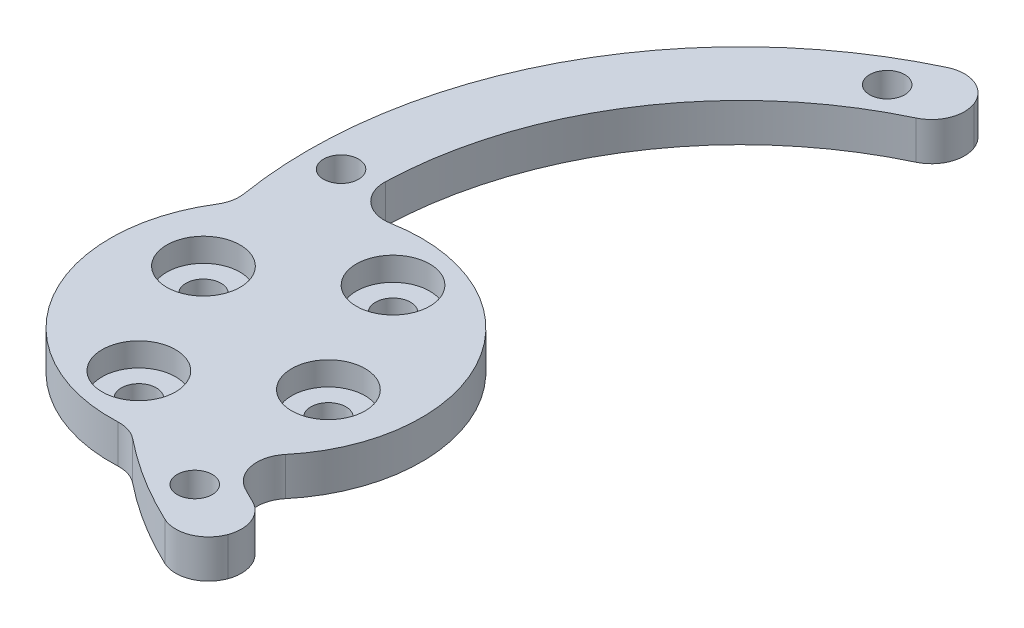
ISO-10303-21;
HEADER;
FILE_DESCRIPTION(('STEP AP214'),'2;1');
FILE_NAME('part.step','',(''),(''),'','','');
FILE_SCHEMA(('AUTOMOTIVE_DESIGN { 1 0 10303 214 1 1 1 1 }'));
ENDSEC;
DATA;
#1=APPLICATION_CONTEXT('core data for automotive mechanical design processes');
#2=APPLICATION_PROTOCOL_DEFINITION('international standard','automotive_design',2000,#1);
#3=PRODUCT_CONTEXT('',#1,'mechanical');
#4=PRODUCT('Part','Part','',(#3));
#5=PRODUCT_RELATED_PRODUCT_CATEGORY('part','',(#4));
#6=PRODUCT_DEFINITION_FORMATION('','',#4);
#7=PRODUCT_DEFINITION_CONTEXT('part definition',#1,'design');
#8=PRODUCT_DEFINITION('design','',#6,#7);
#9=PRODUCT_DEFINITION_SHAPE('','',#8);
#10=(LENGTH_UNIT() NAMED_UNIT(*) SI_UNIT(.MILLI.,.METRE.));
#11=(NAMED_UNIT(*) PLANE_ANGLE_UNIT() SI_UNIT($,.RADIAN.));
#12=(NAMED_UNIT(*) SI_UNIT($,.STERADIAN.) SOLID_ANGLE_UNIT());
#13=UNCERTAINTY_MEASURE_WITH_UNIT(LENGTH_MEASURE(1.E-05),#10,'distance_accuracy_value','');
#14=(GEOMETRIC_REPRESENTATION_CONTEXT(3) GLOBAL_UNCERTAINTY_ASSIGNED_CONTEXT((#13)) GLOBAL_UNIT_ASSIGNED_CONTEXT((#10,
#11,#12)) REPRESENTATION_CONTEXT('',''));
#15=CARTESIAN_POINT('',(0.,0.,0.));
#16=DIRECTION('',(0.,0.,1.));
#17=DIRECTION('',(1.,0.,0.));
#18=AXIS2_PLACEMENT_3D('',#15,#16,#17);
#19=CARTESIAN_POINT('',(-27.3778082191781,3.5,15.979537449936));
#20=DIRECTION('',(0.,-1.,0.));
#21=DIRECTION('',(0.,0.,-1.));
#22=AXIS2_PLACEMENT_3D('',#19,#20,#21);
#23=CYLINDRICAL_SURFACE('',#22,14.2);
#24=CARTESIAN_POINT('',(-27.3778082191781,0.,15.979537449936));
#25=DIRECTION('',(0.,1.,0.));
#26=DIRECTION('',(0.,0.,1.));
#27=AXIS2_PLACEMENT_3D('',#24,#25,#26);
#28=CIRCLE('',#27,14.2);
#29=CARTESIAN_POINT('',(-39.4054645314723,0.,8.43132682533564));
#30=VERTEX_POINT('',#29);
#31=CARTESIAN_POINT('',(-26.7206212695849,0.,30.1643217385067));
#32=VERTEX_POINT('',#31);
#33=EDGE_CURVE('E252',#30,#32,#28,.T.);
#34=ORIENTED_EDGE('',*,*,#33,.T.);
#35=DIRECTION('',(0.,-1.,0.));
#36=VECTOR('',#35,1.);
#37=CARTESIAN_POINT('',(-26.7206212695849,3.5,30.1643217385067));
#38=LINE('',#37,#36);
#39=CARTESIAN_POINT('',(-26.7206212695849,3.5,30.1643217385067));
#40=VERTEX_POINT('',#39);
#41=EDGE_CURVE('E201',#32,#40,#38,.F.);
#42=ORIENTED_EDGE('',*,*,#41,.T.);
#43=CARTESIAN_POINT('',(-27.3778082191781,3.5,15.979537449936));
#44=DIRECTION('',(0.,1.,0.));
#45=DIRECTION('',(0.,0.,1.));
#46=AXIS2_PLACEMENT_3D('',#43,#44,#45);
#47=CIRCLE('',#46,14.2);
#48=CARTESIAN_POINT('',(-39.4054645314723,3.5,8.43132682533564));
#49=VERTEX_POINT('',#48);
#50=EDGE_CURVE('E253',#49,#40,#47,.T.);
#51=ORIENTED_EDGE('',*,*,#50,.F.);
#52=DIRECTION('',(0.,-1.,0.));
#53=VECTOR('',#52,1.);
#54=CARTESIAN_POINT('',(-39.4054645314723,3.5,8.43132682533564));
#55=LINE('',#54,#53);
#56=EDGE_CURVE('E198',#49,#30,#55,.T.);
#57=ORIENTED_EDGE('',*,*,#56,.T.);
#58=EDGE_LOOP('',(#34,#42,#51,#57));
#59=FACE_BOUND('',#58,.T.);
#60=ADVANCED_FACE('F35',(#59),#23,.T.);
#61=CARTESIAN_POINT('',(0.,3.5,0.));
#62=DIRECTION('',(0.,-1.,0.));
#63=DIRECTION('',(0.,0.,-1.));
#64=AXIS2_PLACEMENT_3D('',#61,#62,#63);
#65=CYLINDRICAL_SURFACE('',#64,39.5);
#66=CARTESIAN_POINT('',(0.,0.,0.));
#67=DIRECTION('',(0.,1.,0.));
#68=DIRECTION('',(0.,0.,1.));
#69=AXIS2_PLACEMENT_3D('',#66,#67,#68);
#70=CIRCLE('',#69,39.5);
#71=CARTESIAN_POINT('',(-24.7054180887877,0.,30.8203231173555));
#72=VERTEX_POINT('',#71);
#73=CARTESIAN_POINT('',(-16.8715597782838,0.,35.7155494238545));
#74=VERTEX_POINT('',#73);
#75=EDGE_CURVE('E268',#72,#74,#70,.T.);
#76=ORIENTED_EDGE('',*,*,#75,.T.);
#77=DIRECTION('',(0.,-1.,0.));
#78=VECTOR('',#77,1.);
#79=CARTESIAN_POINT('',(-16.8715597782838,3.5,35.7155494238545));
#80=LINE('',#79,#78);
#81=CARTESIAN_POINT('',(-16.8715597782838,3.5,35.7155494238545));
#82=VERTEX_POINT('',#81);
#83=EDGE_CURVE('E196',#74,#82,#80,.F.);
#84=ORIENTED_EDGE('',*,*,#83,.T.);
#85=CARTESIAN_POINT('',(0.,3.5,0.));
#86=DIRECTION('',(0.,1.,0.));
#87=DIRECTION('',(0.,0.,1.));
#88=AXIS2_PLACEMENT_3D('',#85,#86,#87);
#89=CIRCLE('',#88,39.5);
#90=CARTESIAN_POINT('',(-24.7054180887877,3.5,30.8203231173555));
#91=VERTEX_POINT('',#90);
#92=EDGE_CURVE('E256',#91,#82,#89,.T.);
#93=ORIENTED_EDGE('',*,*,#92,.F.);
#94=DIRECTION('',(0.,-1.,0.));
#95=VECTOR('',#94,1.);
#96=CARTESIAN_POINT('',(-24.7054180887877,3.5,30.8203231173555));
#97=LINE('',#96,#95);
#98=EDGE_CURVE('E193',#91,#72,#97,.T.);
#99=ORIENTED_EDGE('',*,*,#98,.T.);
#100=EDGE_LOOP('',(#76,#84,#93,#99));
#101=FACE_BOUND('',#100,.T.);
#102=ADVANCED_FACE('F302',(#101),#65,.T.);
#103=CARTESIAN_POINT('',(0.,3.5,0.));
#104=DIRECTION('',(0.,-1.,0.));
#105=DIRECTION('',(0.,0.,-1.));
#106=AXIS2_PLACEMENT_3D('',#103,#104,#105);
#107=CYLINDRICAL_SURFACE('',#106,33.5);
#108=CARTESIAN_POINT('',(0.,0.,0.));
#109=DIRECTION('',(0.,1.,0.));
#110=DIRECTION('',(0.,0.,1.));
#111=AXIS2_PLACEMENT_3D('',#108,#109,#110);
#112=CIRCLE('',#111,33.5);
#113=CARTESIAN_POINT('',(-15.5708562956568,0.,29.6613963632868));
#114=VERTEX_POINT('',#113);
#115=CARTESIAN_POINT('',(-14.3087912043673,0.,30.2904026759273));
#116=VERTEX_POINT('',#115);
#117=EDGE_CURVE('E271',#114,#116,#112,.T.);
#118=ORIENTED_EDGE('',*,*,#117,.F.);
#119=DIRECTION('',(0.,-1.,0.));
#120=VECTOR('',#119,1.);
#121=CARTESIAN_POINT('',(-15.5708562956568,3.5,29.6613963632868));
#122=LINE('',#121,#120);
#123=CARTESIAN_POINT('',(-15.5708562956568,3.5,29.6613963632868));
#124=VERTEX_POINT('',#123);
#125=EDGE_CURVE('E181',#114,#124,#122,.F.);
#126=ORIENTED_EDGE('',*,*,#125,.T.);
#127=CARTESIAN_POINT('',(0.,3.5,0.));
#128=DIRECTION('',(0.,1.,0.));
#129=DIRECTION('',(0.,0.,1.));
#130=AXIS2_PLACEMENT_3D('',#127,#128,#129);
#131=CIRCLE('',#130,33.5);
#132=CARTESIAN_POINT('',(-14.3087912043673,3.5,30.2904026759273));
#133=VERTEX_POINT('',#132);
#134=EDGE_CURVE('E259',#124,#133,#131,.T.);
#135=ORIENTED_EDGE('',*,*,#134,.T.);
#136=DIRECTION('',(0.,-1.,0.));
#137=VECTOR('',#136,1.);
#138=CARTESIAN_POINT('',(-14.3087912043673,3.5,30.2904026759273));
#139=LINE('',#138,#137);
#140=EDGE_CURVE('E178',#133,#116,#139,.T.);
#141=ORIENTED_EDGE('',*,*,#140,.T.);
#142=EDGE_LOOP('',(#118,#126,#135,#141));
#143=FACE_BOUND('',#142,.T.);
#144=ADVANCED_FACE('F291',(#143),#107,.F.);
#145=CARTESIAN_POINT('',(-27.3778082191781,3.5,15.979537449936));
#146=DIRECTION('',(0.,-1.,0.));
#147=DIRECTION('',(0.,0.,-1.));
#148=AXIS2_PLACEMENT_3D('',#145,#146,#147);
#149=CYLINDRICAL_SURFACE('',#148,14.2);
#150=CARTESIAN_POINT('',(-27.3778082191781,0.,15.979537449936));
#151=DIRECTION('',(0.,1.,0.));
#152=DIRECTION('',(0.,0.,1.));
#153=AXIS2_PLACEMENT_3D('',#150,#151,#152);
#154=CIRCLE('',#153,14.2);
#155=CARTESIAN_POINT('',(-16.4790135155786,0.,25.0820796228013));
#156=VERTEX_POINT('',#155);
#157=CARTESIAN_POINT('',(-29.94353699167,0.,2.01325534387757));
#158=VERTEX_POINT('',#157);
#159=EDGE_CURVE('E162',#156,#158,#154,.T.);
#160=ORIENTED_EDGE('',*,*,#159,.T.);
#161=DIRECTION('',(0.,-1.,0.));
#162=VECTOR('',#161,1.);
#163=CARTESIAN_POINT('',(-29.94353699167,3.5,2.01325534387757));
#164=LINE('',#163,#162);
#165=CARTESIAN_POINT('',(-29.94353699167,3.5,2.01325534387757));
#166=VERTEX_POINT('',#165);
#167=EDGE_CURVE('E176',#158,#166,#164,.F.);
#168=ORIENTED_EDGE('',*,*,#167,.T.);
#169=CARTESIAN_POINT('',(-27.3778082191781,3.5,15.979537449936));
#170=DIRECTION('',(0.,1.,0.));
#171=DIRECTION('',(0.,0.,1.));
#172=AXIS2_PLACEMENT_3D('',#169,#170,#171);
#173=CIRCLE('',#172,14.2);
#174=CARTESIAN_POINT('',(-16.4790135155786,3.5,25.0820796228013));
#175=VERTEX_POINT('',#174);
#176=EDGE_CURVE('E262',#175,#166,#173,.T.);
#177=ORIENTED_EDGE('',*,*,#176,.F.);
#178=DIRECTION('',(0.,-1.,0.));
#179=VECTOR('',#178,1.);
#180=CARTESIAN_POINT('',(-16.4790135155786,3.5,25.0820796228013));
#181=LINE('',#180,#179);
#182=EDGE_CURVE('E168',#175,#156,#181,.T.);
#183=ORIENTED_EDGE('',*,*,#182,.T.);
#184=EDGE_LOOP('',(#160,#168,#177,#183));
#185=FACE_BOUND('',#184,.T.);
#186=ADVANCED_FACE('F277',(#185),#149,.T.);
#187=CARTESIAN_POINT('',(0.,3.5,0.));
#188=DIRECTION('',(0.,-1.,0.));
#189=DIRECTION('',(0.,0.,-1.));
#190=AXIS2_PLACEMENT_3D('',#187,#188,#189);
#191=CYLINDRICAL_SURFACE('',#190,33.5);
#192=CARTESIAN_POINT('',(0.,3.5,0.));
#193=DIRECTION('',(0.,1.,0.));
#194=DIRECTION('',(0.,0.,1.));
#195=AXIS2_PLACEMENT_3D('',#192,#193,#194);
#196=CIRCLE('',#195,33.5);
#197=CARTESIAN_POINT('',(-14.3087912043673,3.5,-30.2904026759272));
#198=VERTEX_POINT('',#197);
#199=CARTESIAN_POINT('',(-33.4841752218261,3.5,-1.02956773164699));
#200=VERTEX_POINT('',#199);
#201=EDGE_CURVE('E170',#198,#200,#196,.T.);
#202=ORIENTED_EDGE('',*,*,#201,.T.);
#203=DIRECTION('',(0.,-1.,0.));
#204=VECTOR('',#203,1.);
#205=CARTESIAN_POINT('',(-33.4841752218261,3.5,-1.02956773164699));
#206=LINE('',#205,#204);
#207=CARTESIAN_POINT('',(-33.4841752218261,0.,-1.02956773164699));
#208=VERTEX_POINT('',#207);
#209=EDGE_CURVE('E160',#200,#208,#206,.T.);
#210=ORIENTED_EDGE('',*,*,#209,.T.);
#211=CARTESIAN_POINT('',(0.,0.,0.));
#212=DIRECTION('',(0.,1.,0.));
#213=DIRECTION('',(0.,0.,1.));
#214=AXIS2_PLACEMENT_3D('',#211,#212,#213);
#215=CIRCLE('',#214,33.5);
#216=CARTESIAN_POINT('',(-14.3087912043673,0.,-30.2904026759272));
#217=VERTEX_POINT('',#216);
#218=EDGE_CURVE('E142',#217,#208,#215,.T.);
#219=ORIENTED_EDGE('',*,*,#218,.F.);
#220=DIRECTION('',(0.,-1.,0.));
#221=VECTOR('',#220,1.);
#222=CARTESIAN_POINT('',(-14.3087912043673,3.5,-30.2904026759272));
#223=LINE('',#222,#221);
#224=EDGE_CURVE('E157',#217,#198,#223,.F.);
#225=ORIENTED_EDGE('',*,*,#224,.T.);
#226=EDGE_LOOP('',(#202,#210,#219,#225));
#227=FACE_BOUND('',#226,.T.);
#228=ADVANCED_FACE('F156',(#227),#191,.F.);
#229=CARTESIAN_POINT('',(0.,3.5,0.));
#230=DIRECTION('',(0.,-1.,0.));
#231=DIRECTION('',(0.,0.,-1.));
#232=AXIS2_PLACEMENT_3D('',#229,#230,#231);
#233=CYLINDRICAL_SURFACE('',#232,39.5);
#234=CARTESIAN_POINT('',(0.,0.,0.));
#235=DIRECTION('',(0.,1.,0.));
#236=DIRECTION('',(0.,0.,1.));
#237=AXIS2_PLACEMENT_3D('',#234,#235,#236);
#238=CIRCLE('',#237,39.5);
#239=CARTESIAN_POINT('',(-16.8715597782839,0.,-35.7155494238545));
#240=VERTEX_POINT('',#239);
#241=CARTESIAN_POINT('',(-38.9855879514659,0.,6.35404847939623));
#242=VERTEX_POINT('',#241);
#243=EDGE_CURVE('E161',#240,#242,#238,.T.);
#244=ORIENTED_EDGE('',*,*,#243,.T.);
#245=DIRECTION('',(0.,-1.,0.));
#246=VECTOR('',#245,1.);
#247=CARTESIAN_POINT('',(-38.9855879514659,3.5,6.35404847939623));
#248=LINE('',#247,#246);
#249=CARTESIAN_POINT('',(-38.9855879514659,3.5,6.35404847939623));
#250=VERTEX_POINT('',#249);
#251=EDGE_CURVE('E52',#242,#250,#248,.F.);
#252=ORIENTED_EDGE('',*,*,#251,.T.);
#253=CARTESIAN_POINT('',(0.,3.5,0.));
#254=DIRECTION('',(0.,1.,0.));
#255=DIRECTION('',(0.,0.,1.));
#256=AXIS2_PLACEMENT_3D('',#253,#254,#255);
#257=CIRCLE('',#256,39.5);
#258=CARTESIAN_POINT('',(-16.8715597782839,3.5,-35.7155494238545));
#259=VERTEX_POINT('',#258);
#260=EDGE_CURVE('E166',#259,#250,#257,.T.);
#261=ORIENTED_EDGE('',*,*,#260,.F.);
#262=DIRECTION('',(0.,-1.,0.));
#263=VECTOR('',#262,1.);
#264=CARTESIAN_POINT('',(-16.8715597782839,3.5,-35.7155494238545));
#265=LINE('',#264,#263);
#266=EDGE_CURVE('E203',#259,#240,#265,.T.);
#267=ORIENTED_EDGE('',*,*,#266,.T.);
#268=EDGE_LOOP('',(#244,#252,#261,#267));
#269=FACE_BOUND('',#268,.T.);
#270=ADVANCED_FACE('F315',(#269),#233,.T.);
#271=CARTESIAN_POINT('',(0.,3.5,0.));
#272=DIRECTION('',(0.,1.,0.));
#273=DIRECTION('',(0.,0.,1.));
#274=AXIS2_PLACEMENT_3D('',#271,#272,#273);
#275=PLANE('',#274);
#276=CARTESIAN_POINT('',(-24.9624123747001,3.5,6.79172688841051));
#277=DIRECTION('',(0.,1.,0.));
#278=DIRECTION('',(0.,0.,1.));
#279=AXIS2_PLACEMENT_3D('',#276,#277,#278);
#280=CIRCLE('',#279,3.35);
#281=CARTESIAN_POINT('',(-24.9624123747001,3.5,10.1417268884105));
#282=VERTEX_POINT('',#281);
#283=EDGE_CURVE('E617',#282,#282,#280,.T.);
#284=ORIENTED_EDGE('',*,*,#283,.F.);
#285=EDGE_LOOP('',(#284));
#286=FACE_BOUND('',#285,.T.);
#287=CARTESIAN_POINT('',(-19.6407045884198,3.5,18.0135550031805));
#288=DIRECTION('',(0.,1.,0.));
#289=DIRECTION('',(0.,0.,1.));
#290=AXIS2_PLACEMENT_3D('',#287,#288,#289);
#291=CIRCLE('',#290,3.35);
#292=CARTESIAN_POINT('',(-19.6407045884198,3.5,21.3635550031805));
#293=VERTEX_POINT('',#292);
#294=EDGE_CURVE('E627',#293,#293,#291,.T.);
#295=ORIENTED_EDGE('',*,*,#294,.F.);
#296=EDGE_LOOP('',(#295));
#297=FACE_BOUND('',#296,.T.);
#298=CARTESIAN_POINT('',(-35.1149118499364,3.5,13.9455198966914));
#299=DIRECTION('',(0.,1.,0.));
#300=DIRECTION('',(0.,0.,1.));
#301=AXIS2_PLACEMENT_3D('',#298,#299,#300);
#302=CIRCLE('',#301,3.35);
#303=CARTESIAN_POINT('',(-35.1149118499364,3.5,17.2955198966914));
#304=VERTEX_POINT('',#303);
#305=EDGE_CURVE('E639',#304,#304,#302,.T.);
#306=ORIENTED_EDGE('',*,*,#305,.F.);
#307=EDGE_LOOP('',(#306));
#308=FACE_BOUND('',#307,.T.);
#309=CARTESIAN_POINT('',(-29.793204063656,3.5,25.1673480114614));
#310=DIRECTION('',(0.,1.,0.));
#311=DIRECTION('',(0.,0.,1.));
#312=AXIS2_PLACEMENT_3D('',#309,#310,#311);
#313=CIRCLE('',#312,3.35);
#314=CARTESIAN_POINT('',(-29.793204063656,3.5,28.5173480114614));
#315=VERTEX_POINT('',#314);
#316=EDGE_CURVE('E651',#315,#315,#313,.T.);
#317=ORIENTED_EDGE('',*,*,#316,.F.);
#318=EDGE_LOOP('',(#317));
#319=FACE_BOUND('',#318,.T.);
#320=CARTESIAN_POINT('',(-36.5,3.5,0.));
#321=DIRECTION('',(0.,1.,0.));
#322=DIRECTION('',(0.,0.,1.));
#323=AXIS2_PLACEMENT_3D('',#320,#321,#322);
#324=CIRCLE('',#323,1.6);
#325=CARTESIAN_POINT('',(-36.5,3.5,1.6));
#326=VERTEX_POINT('',#325);
#327=EDGE_CURVE('E220',#326,#326,#324,.T.);
#328=ORIENTED_EDGE('',*,*,#327,.F.);
#329=EDGE_LOOP('',(#328));
#330=FACE_BOUND('',#329,.T.);
#331=CARTESIAN_POINT('',(-18.25,3.5,31.609927238132));
#332=DIRECTION('',(0.,1.,0.));
#333=DIRECTION('',(0.,0.,1.));
#334=AXIS2_PLACEMENT_3D('',#331,#332,#333);
#335=CIRCLE('',#334,1.6);
#336=CARTESIAN_POINT('',(-18.25,3.5,33.209927238132));
#337=VERTEX_POINT('',#336);
#338=EDGE_CURVE('E240',#337,#337,#335,.T.);
#339=ORIENTED_EDGE('',*,*,#338,.F.);
#340=EDGE_LOOP('',(#339));
#341=FACE_BOUND('',#340,.T.);
#342=CARTESIAN_POINT('',(-18.2500000000001,3.5,-31.609927238132));
#343=DIRECTION('',(0.,1.,0.));
#344=DIRECTION('',(0.,0.,1.));
#345=AXIS2_PLACEMENT_3D('',#342,#343,#344);
#346=CIRCLE('',#345,1.6);
#347=CARTESIAN_POINT('',(-18.2500000000001,3.5,-30.009927238132));
#348=VERTEX_POINT('',#347);
#349=EDGE_CURVE('E246',#348,#348,#346,.T.);
#350=ORIENTED_EDGE('',*,*,#349,.F.);
#351=EDGE_LOOP('',(#350));
#352=FACE_BOUND('',#351,.T.);
#353=CARTESIAN_POINT('',(-15.5901754913256,3.5,33.0029760498909));
#354=DIRECTION('',(0.,1.,0.));
#355=DIRECTION('',(0.,0.,1.));
#356=AXIS2_PLACEMENT_3D('',#353,#354,#355);
#357=CIRCLE('',#356,3.);
#358=CARTESIAN_POINT('',(-12.7814607670476,3.5,34.0570735774585));
#359=VERTEX_POINT('',#358);
#360=EDGE_CURVE('E189',#82,#359,#357,.T.);
#361=ORIENTED_EDGE('',*,*,#360,.T.);
#362=CARTESIAN_POINT('',(-15.5901754913256,3.5,33.0029760498909));
#363=DIRECTION('',(0.,1.,0.));
#364=DIRECTION('',(0.,0.,1.));
#365=AXIS2_PLACEMENT_3D('',#362,#363,#364);
#366=CIRCLE('',#365,3.);
#367=EDGE_CURVE('E191',#359,#133,#366,.T.);
#368=ORIENTED_EDGE('',*,*,#367,.T.);
#369=ORIENTED_EDGE('',*,*,#134,.F.);
#370=CARTESIAN_POINT('',(-14.1764512542547,3.5,27.0051519128432));
#371=DIRECTION('',(0.,1.,0.));
#372=DIRECTION('',(0.,0.,1.));
#373=AXIS2_PLACEMENT_3D('',#370,#371,#372);
#374=CIRCLE('',#373,3.);
#375=EDGE_CURVE('E212',#124,#175,#374,.F.);
#376=ORIENTED_EDGE('',*,*,#375,.T.);
#377=ORIENTED_EDGE('',*,*,#176,.T.);
#378=CARTESIAN_POINT('',(-30.4855923661402,3.5,-0.937367636275615));
#379=DIRECTION('',(0.,1.,0.));
#380=DIRECTION('',(0.,0.,1.));
#381=AXIS2_PLACEMENT_3D('',#378,#379,#380);
#382=CIRCLE('',#381,3.);
#383=EDGE_CURVE('E208',#166,#200,#382,.F.);
#384=ORIENTED_EDGE('',*,*,#383,.T.);
#385=ORIENTED_EDGE('',*,*,#201,.F.);
#386=CARTESIAN_POINT('',(-15.5901754913256,3.5,-33.0029760498909));
#387=DIRECTION('',(0.,1.,0.));
#388=DIRECTION('',(0.,0.,1.));
#389=AXIS2_PLACEMENT_3D('',#386,#387,#388);
#390=CIRCLE('',#389,3.);
#391=CARTESIAN_POINT('',(-12.7814607670477,3.5,-34.0570735774585));
#392=VERTEX_POINT('',#391);
#393=EDGE_CURVE('E165',#198,#392,#390,.T.);
#394=ORIENTED_EDGE('',*,*,#393,.T.);
#395=CARTESIAN_POINT('',(-15.5901754913256,3.5,-33.0029760498909));
#396=DIRECTION('',(0.,1.,0.));
#397=DIRECTION('',(0.,0.,1.));
#398=AXIS2_PLACEMENT_3D('',#395,#396,#397);
#399=CIRCLE('',#398,3.);
#400=EDGE_CURVE('E59',#392,#259,#399,.T.);
#401=ORIENTED_EDGE('',*,*,#400,.T.);
#402=ORIENTED_EDGE('',*,*,#260,.T.);
#403=CARTESIAN_POINT('',(-41.946518681957,3.5,6.8366344398567));
#404=DIRECTION('',(0.,1.,0.));
#405=DIRECTION('',(0.,0.,1.));
#406=AXIS2_PLACEMENT_3D('',#403,#404,#405);
#407=CIRCLE('',#406,3.);
#408=EDGE_CURVE('E11',#250,#49,#407,.F.);
#409=ORIENTED_EDGE('',*,*,#408,.T.);
#410=ORIENTED_EDGE('',*,*,#50,.T.);
#411=CARTESIAN_POINT('',(-26.5817789562906,3.5,33.1611071515851));
#412=DIRECTION('',(0.,1.,0.));
#413=DIRECTION('',(0.,0.,1.));
#414=AXIS2_PLACEMENT_3D('',#411,#412,#413);
#415=CIRCLE('',#414,3.);
#416=EDGE_CURVE('E216',#40,#91,#415,.F.);
#417=ORIENTED_EDGE('',*,*,#416,.T.);
#418=ORIENTED_EDGE('',*,*,#92,.T.);
#419=EDGE_LOOP('',(#361,#368,#369,#376,#377,#384,#385,#394,#401,#402,#409,#410,#417,#418));
#420=FACE_BOUND('',#419,.T.);
#421=ADVANCED_FACE('F283',(#286,#297,#308,#319,#330,#341,#352,#420),#275,.T.);
#422=CARTESIAN_POINT('',(0.,0.,0.));
#423=DIRECTION('',(0.,1.,0.));
#424=DIRECTION('',(0.,0.,1.));
#425=AXIS2_PLACEMENT_3D('',#422,#423,#424);
#426=PLANE('',#425);
#427=CARTESIAN_POINT('',(-24.9624123747001,0.,6.79172688841051));
#428=DIRECTION('',(0.,1.,0.));
#429=DIRECTION('',(0.,0.,1.));
#430=AXIS2_PLACEMENT_3D('',#427,#428,#429);
#431=CIRCLE('',#430,1.6);
#432=CARTESIAN_POINT('',(-24.9624123747001,0.,8.39172688841051));
#433=VERTEX_POINT('',#432);
#434=EDGE_CURVE('E624',#433,#433,#431,.T.);
#435=ORIENTED_EDGE('',*,*,#434,.T.);
#436=EDGE_LOOP('',(#435));
#437=FACE_BOUND('',#436,.T.);
#438=CARTESIAN_POINT('',(-19.6407045884198,0.,18.0135550031805));
#439=DIRECTION('',(0.,1.,0.));
#440=DIRECTION('',(0.,0.,1.));
#441=AXIS2_PLACEMENT_3D('',#438,#439,#440);
#442=CIRCLE('',#441,1.6);
#443=CARTESIAN_POINT('',(-19.6407045884198,0.,19.6135550031805));
#444=VERTEX_POINT('',#443);
#445=EDGE_CURVE('E636',#444,#444,#442,.T.);
#446=ORIENTED_EDGE('',*,*,#445,.T.);
#447=EDGE_LOOP('',(#446));
#448=FACE_BOUND('',#447,.T.);
#449=CARTESIAN_POINT('',(-35.1149118499364,0.,13.9455198966914));
#450=DIRECTION('',(0.,1.,0.));
#451=DIRECTION('',(0.,0.,1.));
#452=AXIS2_PLACEMENT_3D('',#449,#450,#451);
#453=CIRCLE('',#452,1.6);
#454=CARTESIAN_POINT('',(-35.1149118499364,0.,15.5455198966914));
#455=VERTEX_POINT('',#454);
#456=EDGE_CURVE('E648',#455,#455,#453,.T.);
#457=ORIENTED_EDGE('',*,*,#456,.T.);
#458=EDGE_LOOP('',(#457));
#459=FACE_BOUND('',#458,.T.);
#460=CARTESIAN_POINT('',(-29.793204063656,0.,25.1673480114614));
#461=DIRECTION('',(0.,1.,0.));
#462=DIRECTION('',(0.,0.,1.));
#463=AXIS2_PLACEMENT_3D('',#460,#461,#462);
#464=CIRCLE('',#463,1.6);
#465=CARTESIAN_POINT('',(-29.793204063656,0.,26.7673480114614));
#466=VERTEX_POINT('',#465);
#467=EDGE_CURVE('E227',#466,#466,#464,.T.);
#468=ORIENTED_EDGE('',*,*,#467,.T.);
#469=EDGE_LOOP('',(#468));
#470=FACE_BOUND('',#469,.T.);
#471=CARTESIAN_POINT('',(-36.5,0.,0.));
#472=DIRECTION('',(0.,1.,0.));
#473=DIRECTION('',(0.,0.,1.));
#474=AXIS2_PLACEMENT_3D('',#471,#472,#473);
#475=CIRCLE('',#474,1.6);
#476=CARTESIAN_POINT('',(-36.5,0.,1.6));
#477=VERTEX_POINT('',#476);
#478=EDGE_CURVE('E225',#477,#477,#475,.T.);
#479=ORIENTED_EDGE('',*,*,#478,.T.);
#480=EDGE_LOOP('',(#479));
#481=FACE_BOUND('',#480,.T.);
#482=CARTESIAN_POINT('',(-18.25,0.,31.609927238132));
#483=DIRECTION('',(0.,1.,0.));
#484=DIRECTION('',(0.,0.,1.));
#485=AXIS2_PLACEMENT_3D('',#482,#483,#484);
#486=CIRCLE('',#485,1.6);
#487=CARTESIAN_POINT('',(-18.25,0.,33.209927238132));
#488=VERTEX_POINT('',#487);
#489=EDGE_CURVE('E243',#488,#488,#486,.T.);
#490=ORIENTED_EDGE('',*,*,#489,.T.);
#491=EDGE_LOOP('',(#490));
#492=FACE_BOUND('',#491,.T.);
#493=CARTESIAN_POINT('',(-18.2500000000001,0.,-31.609927238132));
#494=DIRECTION('',(0.,1.,0.));
#495=DIRECTION('',(0.,0.,1.));
#496=AXIS2_PLACEMENT_3D('',#493,#494,#495);
#497=CIRCLE('',#496,1.6);
#498=CARTESIAN_POINT('',(-18.2500000000001,0.,-30.009927238132));
#499=VERTEX_POINT('',#498);
#500=EDGE_CURVE('E249',#499,#499,#497,.T.);
#501=ORIENTED_EDGE('',*,*,#500,.T.);
#502=EDGE_LOOP('',(#501));
#503=FACE_BOUND('',#502,.T.);
#504=ORIENTED_EDGE('',*,*,#117,.T.);
#505=CARTESIAN_POINT('',(-15.5901754913256,0.,33.0029760498909));
#506=DIRECTION('',(0.,1.,0.));
#507=DIRECTION('',(0.,0.,1.));
#508=AXIS2_PLACEMENT_3D('',#505,#506,#507);
#509=CIRCLE('',#508,3.);
#510=CARTESIAN_POINT('',(-12.7814607670476,0.,34.0570735774585));
#511=VERTEX_POINT('',#510);
#512=EDGE_CURVE('E185',#116,#511,#509,.F.);
#513=ORIENTED_EDGE('',*,*,#512,.T.);
#514=CARTESIAN_POINT('',(-15.5901754913256,0.,33.0029760498909));
#515=DIRECTION('',(0.,1.,0.));
#516=DIRECTION('',(0.,0.,1.));
#517=AXIS2_PLACEMENT_3D('',#514,#515,#516);
#518=CIRCLE('',#517,3.);
#519=EDGE_CURVE('E150',#511,#74,#518,.F.);
#520=ORIENTED_EDGE('',*,*,#519,.T.);
#521=ORIENTED_EDGE('',*,*,#75,.F.);
#522=CARTESIAN_POINT('',(-26.5817789562906,0.,33.1611071515851));
#523=DIRECTION('',(0.,1.,0.));
#524=DIRECTION('',(0.,0.,1.));
#525=AXIS2_PLACEMENT_3D('',#522,#523,#524);
#526=CIRCLE('',#525,3.);
#527=EDGE_CURVE('E214',#72,#32,#526,.T.);
#528=ORIENTED_EDGE('',*,*,#527,.T.);
#529=ORIENTED_EDGE('',*,*,#33,.F.);
#530=CARTESIAN_POINT('',(-41.946518681957,0.,6.8366344398567));
#531=DIRECTION('',(0.,1.,0.));
#532=DIRECTION('',(0.,0.,1.));
#533=AXIS2_PLACEMENT_3D('',#530,#531,#532);
#534=CIRCLE('',#533,3.);
#535=EDGE_CURVE('E44',#30,#242,#534,.T.);
#536=ORIENTED_EDGE('',*,*,#535,.T.);
#537=ORIENTED_EDGE('',*,*,#243,.F.);
#538=CARTESIAN_POINT('',(-15.5901754913256,0.,-33.0029760498909));
#539=DIRECTION('',(0.,1.,0.));
#540=DIRECTION('',(0.,0.,1.));
#541=AXIS2_PLACEMENT_3D('',#538,#539,#540);
#542=CIRCLE('',#541,3.);
#543=CARTESIAN_POINT('',(-12.7814607670477,0.,-34.0570735774585));
#544=VERTEX_POINT('',#543);
#545=EDGE_CURVE('E145',#240,#544,#542,.F.);
#546=ORIENTED_EDGE('',*,*,#545,.T.);
#547=CARTESIAN_POINT('',(-15.5901754913256,0.,-33.0029760498909));
#548=DIRECTION('',(0.,1.,0.));
#549=DIRECTION('',(0.,0.,1.));
#550=AXIS2_PLACEMENT_3D('',#547,#548,#549);
#551=CIRCLE('',#550,3.);
#552=EDGE_CURVE('E138',#544,#217,#551,.F.);
#553=ORIENTED_EDGE('',*,*,#552,.T.);
#554=ORIENTED_EDGE('',*,*,#218,.T.);
#555=CARTESIAN_POINT('',(-30.4855923661402,0.,-0.937367636275615));
#556=DIRECTION('',(0.,1.,0.));
#557=DIRECTION('',(0.,0.,1.));
#558=AXIS2_PLACEMENT_3D('',#555,#556,#557);
#559=CIRCLE('',#558,3.);
#560=EDGE_CURVE('E206',#208,#158,#559,.T.);
#561=ORIENTED_EDGE('',*,*,#560,.T.);
#562=ORIENTED_EDGE('',*,*,#159,.F.);
#563=CARTESIAN_POINT('',(-14.1764512542547,0.,27.0051519128432));
#564=DIRECTION('',(0.,1.,0.));
#565=DIRECTION('',(0.,0.,1.));
#566=AXIS2_PLACEMENT_3D('',#563,#564,#565);
#567=CIRCLE('',#566,3.);
#568=EDGE_CURVE('E210',#156,#114,#567,.T.);
#569=ORIENTED_EDGE('',*,*,#568,.T.);
#570=EDGE_LOOP('',(#504,#513,#520,#521,#528,#529,#536,#537,#546,#553,#554,#561,#562,#569));
#571=FACE_BOUND('',#570,.T.);
#572=ADVANCED_FACE('F141',(#437,#448,#459,#470,#481,#492,#503,#571),#426,.F.);
#573=CARTESIAN_POINT('',(-18.2500000000001,3.5,-31.609927238132));
#574=DIRECTION('',(0.,1.,0.));
#575=DIRECTION('',(0.,0.,1.));
#576=AXIS2_PLACEMENT_3D('',#573,#574,#575);
#577=CYLINDRICAL_SURFACE('',#576,1.6);
#578=ORIENTED_EDGE('',*,*,#500,.F.);
#579=EDGE_LOOP('',(#578));
#580=FACE_BOUND('',#579,.T.);
#581=ORIENTED_EDGE('',*,*,#349,.T.);
#582=EDGE_LOOP('',(#581));
#583=FACE_BOUND('',#582,.T.);
#584=ADVANCED_FACE('F383',(#580,#583),#577,.F.);
#585=CARTESIAN_POINT('',(-18.25,3.5,31.609927238132));
#586=DIRECTION('',(0.,1.,0.));
#587=DIRECTION('',(0.,0.,1.));
#588=AXIS2_PLACEMENT_3D('',#585,#586,#587);
#589=CYLINDRICAL_SURFACE('',#588,1.6);
#590=ORIENTED_EDGE('',*,*,#489,.F.);
#591=EDGE_LOOP('',(#590));
#592=FACE_BOUND('',#591,.T.);
#593=ORIENTED_EDGE('',*,*,#338,.T.);
#594=EDGE_LOOP('',(#593));
#595=FACE_BOUND('',#594,.T.);
#596=ADVANCED_FACE('F512',(#592,#595),#589,.F.);
#597=CARTESIAN_POINT('',(-36.5,3.5,0.));
#598=DIRECTION('',(0.,1.,0.));
#599=DIRECTION('',(0.,0.,1.));
#600=AXIS2_PLACEMENT_3D('',#597,#598,#599);
#601=CYLINDRICAL_SURFACE('',#600,1.6);
#602=ORIENTED_EDGE('',*,*,#478,.F.);
#603=EDGE_LOOP('',(#602));
#604=FACE_BOUND('',#603,.T.);
#605=ORIENTED_EDGE('',*,*,#327,.T.);
#606=EDGE_LOOP('',(#605));
#607=FACE_BOUND('',#606,.T.);
#608=ADVANCED_FACE('F335',(#604,#607),#601,.F.);
#609=CARTESIAN_POINT('',(-30.4855923661402,3.5,-0.937367636275615));
#610=DIRECTION('',(0.,-1.,0.));
#611=DIRECTION('',(0.,0.,-1.));
#612=AXIS2_PLACEMENT_3D('',#609,#610,#611);
#613=CYLINDRICAL_SURFACE('',#612,3.);
#614=ORIENTED_EDGE('',*,*,#383,.F.);
#615=ORIENTED_EDGE('',*,*,#167,.F.);
#616=ORIENTED_EDGE('',*,*,#560,.F.);
#617=ORIENTED_EDGE('',*,*,#209,.F.);
#618=EDGE_LOOP('',(#614,#615,#616,#617));
#619=FACE_BOUND('',#618,.T.);
#620=ADVANCED_FACE('F282',(#619),#613,.F.);
#621=CARTESIAN_POINT('',(-14.1764512542547,3.5,27.0051519128432));
#622=DIRECTION('',(0.,-1.,0.));
#623=DIRECTION('',(0.,0.,-1.));
#624=AXIS2_PLACEMENT_3D('',#621,#622,#623);
#625=CYLINDRICAL_SURFACE('',#624,3.);
#626=ORIENTED_EDGE('',*,*,#375,.F.);
#627=ORIENTED_EDGE('',*,*,#125,.F.);
#628=ORIENTED_EDGE('',*,*,#568,.F.);
#629=ORIENTED_EDGE('',*,*,#182,.F.);
#630=EDGE_LOOP('',(#626,#627,#628,#629));
#631=FACE_BOUND('',#630,.T.);
#632=ADVANCED_FACE('F287',(#631),#625,.F.);
#633=CARTESIAN_POINT('',(-15.5901754913256,3.5,33.0029760498909));
#634=DIRECTION('',(0.,-1.,0.));
#635=DIRECTION('',(0.,0.,-1.));
#636=AXIS2_PLACEMENT_3D('',#633,#634,#635);
#637=CYLINDRICAL_SURFACE('',#636,3.);
#638=DIRECTION('',(0.,1.,0.));
#639=VECTOR('',#638,1.);
#640=CARTESIAN_POINT('',(-12.7814607670476,0.,34.0570735774585));
#641=LINE('',#640,#639);
#642=EDGE_CURVE('E218',#359,#511,#641,.F.);
#643=ORIENTED_EDGE('',*,*,#642,.F.);
#644=ORIENTED_EDGE('',*,*,#360,.F.);
#645=ORIENTED_EDGE('',*,*,#83,.F.);
#646=ORIENTED_EDGE('',*,*,#519,.F.);
#647=EDGE_LOOP('',(#643,#644,#645,#646));
#648=FACE_BOUND('',#647,.T.);
#649=ADVANCED_FACE('F298',(#648),#637,.T.);
#650=CARTESIAN_POINT('',(-15.5901754913256,3.5,33.0029760498909));
#651=DIRECTION('',(0.,-1.,0.));
#652=DIRECTION('',(0.,0.,-1.));
#653=AXIS2_PLACEMENT_3D('',#650,#651,#652);
#654=CYLINDRICAL_SURFACE('',#653,3.);
#655=ORIENTED_EDGE('',*,*,#367,.F.);
#656=ORIENTED_EDGE('',*,*,#642,.T.);
#657=ORIENTED_EDGE('',*,*,#512,.F.);
#658=ORIENTED_EDGE('',*,*,#140,.F.);
#659=EDGE_LOOP('',(#655,#656,#657,#658));
#660=FACE_BOUND('',#659,.T.);
#661=ADVANCED_FACE('F293',(#660),#654,.T.);
#662=CARTESIAN_POINT('',(-26.5817789562906,3.5,33.1611071515851));
#663=DIRECTION('',(0.,1.,0.));
#664=DIRECTION('',(0.,0.,1.));
#665=AXIS2_PLACEMENT_3D('',#662,#663,#664);
#666=CYLINDRICAL_SURFACE('',#665,3.);
#667=ORIENTED_EDGE('',*,*,#416,.F.);
#668=ORIENTED_EDGE('',*,*,#41,.F.);
#669=ORIENTED_EDGE('',*,*,#527,.F.);
#670=ORIENTED_EDGE('',*,*,#98,.F.);
#671=EDGE_LOOP('',(#667,#668,#669,#670));
#672=FACE_BOUND('',#671,.T.);
#673=ADVANCED_FACE('F308',(#672),#666,.F.);
#674=CARTESIAN_POINT('',(-41.946518681957,3.5,6.8366344398567));
#675=DIRECTION('',(0.,1.,0.));
#676=DIRECTION('',(0.,0.,1.));
#677=AXIS2_PLACEMENT_3D('',#674,#675,#676);
#678=CYLINDRICAL_SURFACE('',#677,3.);
#679=ORIENTED_EDGE('',*,*,#408,.F.);
#680=ORIENTED_EDGE('',*,*,#251,.F.);
#681=ORIENTED_EDGE('',*,*,#535,.F.);
#682=ORIENTED_EDGE('',*,*,#56,.F.);
#683=EDGE_LOOP('',(#679,#680,#681,#682));
#684=FACE_BOUND('',#683,.T.);
#685=ADVANCED_FACE('F314',(#684),#678,.F.);
#686=CARTESIAN_POINT('',(-15.5901754913256,3.5,-33.0029760498909));
#687=DIRECTION('',(0.,-1.,0.));
#688=DIRECTION('',(0.,0.,-1.));
#689=AXIS2_PLACEMENT_3D('',#686,#687,#688);
#690=CYLINDRICAL_SURFACE('',#689,3.);
#691=ORIENTED_EDGE('',*,*,#266,.F.);
#692=ORIENTED_EDGE('',*,*,#400,.F.);
#693=DIRECTION('',(0.,-1.,0.));
#694=VECTOR('',#693,1.);
#695=CARTESIAN_POINT('',(-12.7814607670477,3.5,-34.0570735774585));
#696=LINE('',#695,#694);
#697=EDGE_CURVE('E39',#544,#392,#696,.F.);
#698=ORIENTED_EDGE('',*,*,#697,.F.);
#699=ORIENTED_EDGE('',*,*,#545,.F.);
#700=EDGE_LOOP('',(#691,#692,#698,#699));
#701=FACE_BOUND('',#700,.T.);
#702=ADVANCED_FACE('F37',(#701),#690,.T.);
#703=CARTESIAN_POINT('',(-15.5901754913256,3.5,-33.0029760498909));
#704=DIRECTION('',(0.,-1.,0.));
#705=DIRECTION('',(0.,0.,-1.));
#706=AXIS2_PLACEMENT_3D('',#703,#704,#705);
#707=CYLINDRICAL_SURFACE('',#706,3.);
#708=ORIENTED_EDGE('',*,*,#393,.F.);
#709=ORIENTED_EDGE('',*,*,#224,.F.);
#710=ORIENTED_EDGE('',*,*,#552,.F.);
#711=ORIENTED_EDGE('',*,*,#697,.T.);
#712=EDGE_LOOP('',(#708,#709,#710,#711));
#713=FACE_BOUND('',#712,.T.);
#714=ADVANCED_FACE('F164',(#713),#707,.T.);
#715=CARTESIAN_POINT('',(-29.793204063656,3.5,25.1673480114614));
#716=DIRECTION('',(0.,1.,0.));
#717=DIRECTION('',(0.,0.,1.));
#718=AXIS2_PLACEMENT_3D('',#715,#716,#717);
#719=CYLINDRICAL_SURFACE('',#718,1.6);
#720=ORIENTED_EDGE('',*,*,#467,.F.);
#721=EDGE_LOOP('',(#720));
#722=FACE_BOUND('',#721,.T.);
#723=CARTESIAN_POINT('',(-29.793204063656,1.35,25.1673480114614));
#724=DIRECTION('',(0.,1.,0.));
#725=DIRECTION('',(0.,0.,1.));
#726=AXIS2_PLACEMENT_3D('',#723,#724,#725);
#727=CIRCLE('',#726,1.6);
#728=CARTESIAN_POINT('',(-29.793204063656,1.35,26.7673480114614));
#729=VERTEX_POINT('',#728);
#730=EDGE_CURVE('E229',#729,#729,#727,.T.);
#731=ORIENTED_EDGE('',*,*,#730,.T.);
#732=EDGE_LOOP('',(#731));
#733=FACE_BOUND('',#732,.T.);
#734=ADVANCED_FACE('F323',(#722,#733),#719,.F.);
#735=CARTESIAN_POINT('',(-28.193204063656,1.35,25.1673480114614));
#736=DIRECTION('',(0.,-1.,0.));
#737=DIRECTION('',(0.,0.,-1.));
#738=AXIS2_PLACEMENT_3D('',#735,#736,#737);
#739=PLANE('',#738);
#740=ORIENTED_EDGE('',*,*,#730,.F.);
#741=EDGE_LOOP('',(#740));
#742=FACE_BOUND('',#741,.T.);
#743=CARTESIAN_POINT('',(-29.793204063656,1.35,25.1673480114614));
#744=DIRECTION('',(0.,1.,0.));
#745=DIRECTION('',(0.,0.,1.));
#746=AXIS2_PLACEMENT_3D('',#743,#744,#745);
#747=CIRCLE('',#746,3.35);
#748=CARTESIAN_POINT('',(-29.793204063656,1.35,28.5173480114614));
#749=VERTEX_POINT('',#748);
#750=EDGE_CURVE('E234',#749,#749,#747,.T.);
#751=ORIENTED_EDGE('',*,*,#750,.T.);
#752=EDGE_LOOP('',(#751));
#753=FACE_BOUND('',#752,.T.);
#754=ADVANCED_FACE('F393',(#742,#753),#739,.F.);
#755=CARTESIAN_POINT('',(-29.793204063656,3.5,25.1673480114614));
#756=DIRECTION('',(0.,1.,0.));
#757=DIRECTION('',(0.,0.,1.));
#758=AXIS2_PLACEMENT_3D('',#755,#756,#757);
#759=CYLINDRICAL_SURFACE('',#758,3.35);
#760=ORIENTED_EDGE('',*,*,#750,.F.);
#761=EDGE_LOOP('',(#760));
#762=FACE_BOUND('',#761,.T.);
#763=ORIENTED_EDGE('',*,*,#316,.T.);
#764=EDGE_LOOP('',(#763));
#765=FACE_BOUND('',#764,.T.);
#766=ADVANCED_FACE('F403',(#762,#765),#759,.F.);
#767=CARTESIAN_POINT('',(-35.1149118499364,3.5,13.9455198966914));
#768=DIRECTION('',(0.,1.,0.));
#769=DIRECTION('',(0.,0.,1.));
#770=AXIS2_PLACEMENT_3D('',#767,#768,#769);
#771=CYLINDRICAL_SURFACE('',#770,1.6);
#772=ORIENTED_EDGE('',*,*,#456,.F.);
#773=EDGE_LOOP('',(#772));
#774=FACE_BOUND('',#773,.T.);
#775=CARTESIAN_POINT('',(-35.1149118499364,1.35,13.9455198966914));
#776=DIRECTION('',(0.,1.,0.));
#777=DIRECTION('',(0.,0.,1.));
#778=AXIS2_PLACEMENT_3D('',#775,#776,#777);
#779=CIRCLE('',#778,1.6);
#780=CARTESIAN_POINT('',(-35.1149118499364,1.35,15.5455198966914));
#781=VERTEX_POINT('',#780);
#782=EDGE_CURVE('E645',#781,#781,#779,.T.);
#783=ORIENTED_EDGE('',*,*,#782,.T.);
#784=EDGE_LOOP('',(#783));
#785=FACE_BOUND('',#784,.T.);
#786=ADVANCED_FACE('F413',(#774,#785),#771,.F.);
#787=CARTESIAN_POINT('',(-33.5149118499364,1.35,13.9455198966914));
#788=DIRECTION('',(0.,-1.,0.));
#789=DIRECTION('',(0.,0.,-1.));
#790=AXIS2_PLACEMENT_3D('',#787,#788,#789);
#791=PLANE('',#790);
#792=ORIENTED_EDGE('',*,*,#782,.F.);
#793=EDGE_LOOP('',(#792));
#794=FACE_BOUND('',#793,.T.);
#795=CARTESIAN_POINT('',(-35.1149118499364,1.35,13.9455198966914));
#796=DIRECTION('',(0.,1.,0.));
#797=DIRECTION('',(0.,0.,1.));
#798=AXIS2_PLACEMENT_3D('',#795,#796,#797);
#799=CIRCLE('',#798,3.35);
#800=CARTESIAN_POINT('',(-35.1149118499364,1.35,17.2955198966914));
#801=VERTEX_POINT('',#800);
#802=EDGE_CURVE('E642',#801,#801,#799,.T.);
#803=ORIENTED_EDGE('',*,*,#802,.T.);
#804=EDGE_LOOP('',(#803));
#805=FACE_BOUND('',#804,.T.);
#806=ADVANCED_FACE('F423',(#794,#805),#791,.F.);
#807=CARTESIAN_POINT('',(-35.1149118499364,3.5,13.9455198966914));
#808=DIRECTION('',(0.,1.,0.));
#809=DIRECTION('',(0.,0.,1.));
#810=AXIS2_PLACEMENT_3D('',#807,#808,#809);
#811=CYLINDRICAL_SURFACE('',#810,3.35);
#812=ORIENTED_EDGE('',*,*,#802,.F.);
#813=EDGE_LOOP('',(#812));
#814=FACE_BOUND('',#813,.T.);
#815=ORIENTED_EDGE('',*,*,#305,.T.);
#816=EDGE_LOOP('',(#815));
#817=FACE_BOUND('',#816,.T.);
#818=ADVANCED_FACE('F433',(#814,#817),#811,.F.);
#819=CARTESIAN_POINT('',(-19.6407045884198,3.5,18.0135550031805));
#820=DIRECTION('',(0.,1.,0.));
#821=DIRECTION('',(0.,0.,1.));
#822=AXIS2_PLACEMENT_3D('',#819,#820,#821);
#823=CYLINDRICAL_SURFACE('',#822,1.6);
#824=ORIENTED_EDGE('',*,*,#445,.F.);
#825=EDGE_LOOP('',(#824));
#826=FACE_BOUND('',#825,.T.);
#827=CARTESIAN_POINT('',(-19.6407045884198,1.35,18.0135550031805));
#828=DIRECTION('',(0.,1.,0.));
#829=DIRECTION('',(0.,0.,1.));
#830=AXIS2_PLACEMENT_3D('',#827,#828,#829);
#831=CIRCLE('',#830,1.6);
#832=CARTESIAN_POINT('',(-19.6407045884198,1.35,19.6135550031805));
#833=VERTEX_POINT('',#832);
#834=EDGE_CURVE('E633',#833,#833,#831,.T.);
#835=ORIENTED_EDGE('',*,*,#834,.T.);
#836=EDGE_LOOP('',(#835));
#837=FACE_BOUND('',#836,.T.);
#838=ADVANCED_FACE('F443',(#826,#837),#823,.F.);
#839=CARTESIAN_POINT('',(-18.0407045884198,1.35,18.0135550031805));
#840=DIRECTION('',(0.,-1.,0.));
#841=DIRECTION('',(0.,0.,-1.));
#842=AXIS2_PLACEMENT_3D('',#839,#840,#841);
#843=PLANE('',#842);
#844=ORIENTED_EDGE('',*,*,#834,.F.);
#845=EDGE_LOOP('',(#844));
#846=FACE_BOUND('',#845,.T.);
#847=CARTESIAN_POINT('',(-19.6407045884198,1.35,18.0135550031805));
#848=DIRECTION('',(0.,1.,0.));
#849=DIRECTION('',(0.,0.,1.));
#850=AXIS2_PLACEMENT_3D('',#847,#848,#849);
#851=CIRCLE('',#850,3.35);
#852=CARTESIAN_POINT('',(-19.6407045884198,1.35,21.3635550031805));
#853=VERTEX_POINT('',#852);
#854=EDGE_CURVE('E630',#853,#853,#851,.T.);
#855=ORIENTED_EDGE('',*,*,#854,.T.);
#856=EDGE_LOOP('',(#855));
#857=FACE_BOUND('',#856,.T.);
#858=ADVANCED_FACE('F453',(#846,#857),#843,.F.);
#859=CARTESIAN_POINT('',(-19.6407045884198,3.5,18.0135550031805));
#860=DIRECTION('',(0.,1.,0.));
#861=DIRECTION('',(0.,0.,1.));
#862=AXIS2_PLACEMENT_3D('',#859,#860,#861);
#863=CYLINDRICAL_SURFACE('',#862,3.35);
#864=ORIENTED_EDGE('',*,*,#854,.F.);
#865=EDGE_LOOP('',(#864));
#866=FACE_BOUND('',#865,.T.);
#867=ORIENTED_EDGE('',*,*,#294,.T.);
#868=EDGE_LOOP('',(#867));
#869=FACE_BOUND('',#868,.T.);
#870=ADVANCED_FACE('F463',(#866,#869),#863,.F.);
#871=CARTESIAN_POINT('',(-24.9624123747001,3.5,6.79172688841051));
#872=DIRECTION('',(0.,1.,0.));
#873=DIRECTION('',(0.,0.,1.));
#874=AXIS2_PLACEMENT_3D('',#871,#872,#873);
#875=CYLINDRICAL_SURFACE('',#874,1.6);
#876=ORIENTED_EDGE('',*,*,#434,.F.);
#877=EDGE_LOOP('',(#876));
#878=FACE_BOUND('',#877,.T.);
#879=CARTESIAN_POINT('',(-24.9624123747001,1.35,6.79172688841051));
#880=DIRECTION('',(0.,1.,0.));
#881=DIRECTION('',(0.,0.,1.));
#882=AXIS2_PLACEMENT_3D('',#879,#880,#881);
#883=CIRCLE('',#882,1.6);
#884=CARTESIAN_POINT('',(-24.9624123747001,1.35,8.39172688841051));
#885=VERTEX_POINT('',#884);
#886=EDGE_CURVE('E619',#885,#885,#883,.T.);
#887=ORIENTED_EDGE('',*,*,#886,.T.);
#888=EDGE_LOOP('',(#887));
#889=FACE_BOUND('',#888,.T.);
#890=ADVANCED_FACE('F473',(#878,#889),#875,.F.);
#891=CARTESIAN_POINT('',(-23.3624123747001,1.35,6.79172688841051));
#892=DIRECTION('',(0.,-1.,0.));
#893=DIRECTION('',(0.,0.,-1.));
#894=AXIS2_PLACEMENT_3D('',#891,#892,#893);
#895=PLANE('',#894);
#896=ORIENTED_EDGE('',*,*,#886,.F.);
#897=EDGE_LOOP('',(#896));
#898=FACE_BOUND('',#897,.T.);
#899=CARTESIAN_POINT('',(-24.9624123747001,1.35,6.79172688841051));
#900=DIRECTION('',(0.,1.,0.));
#901=DIRECTION('',(0.,0.,1.));
#902=AXIS2_PLACEMENT_3D('',#899,#900,#901);
#903=CIRCLE('',#902,3.35);
#904=CARTESIAN_POINT('',(-24.9624123747001,1.35,10.1417268884105));
#905=VERTEX_POINT('',#904);
#906=EDGE_CURVE('E614',#905,#905,#903,.T.);
#907=ORIENTED_EDGE('',*,*,#906,.T.);
#908=EDGE_LOOP('',(#907));
#909=FACE_BOUND('',#908,.T.);
#910=ADVANCED_FACE('F483',(#898,#909),#895,.F.);
#911=CARTESIAN_POINT('',(-24.9624123747001,3.5,6.79172688841051));
#912=DIRECTION('',(0.,1.,0.));
#913=DIRECTION('',(0.,0.,1.));
#914=AXIS2_PLACEMENT_3D('',#911,#912,#913);
#915=CYLINDRICAL_SURFACE('',#914,3.35);
#916=ORIENTED_EDGE('',*,*,#906,.F.);
#917=EDGE_LOOP('',(#916));
#918=FACE_BOUND('',#917,.T.);
#919=ORIENTED_EDGE('',*,*,#283,.T.);
#920=EDGE_LOOP('',(#919));
#921=FACE_BOUND('',#920,.T.);
#922=ADVANCED_FACE('F493',(#918,#921),#915,.F.);
#923=CLOSED_SHELL('',(#60,#102,#144,#186,#228,#270,#421,#572,#584,#596,#608,#620,#632,#649,#661,
#673,#685,#702,#714,#734,#754,#766,#786,#806,#818,#838,#858,#870,#890,#910,#922));
#924=MANIFOLD_SOLID_BREP('B2',#923);
#925=ADVANCED_BREP_SHAPE_REPRESENTATION('',(#18,#924),#14);
#926=SHAPE_DEFINITION_REPRESENTATION(#9,#925);
ENDSEC;
END-ISO-10303-21;
